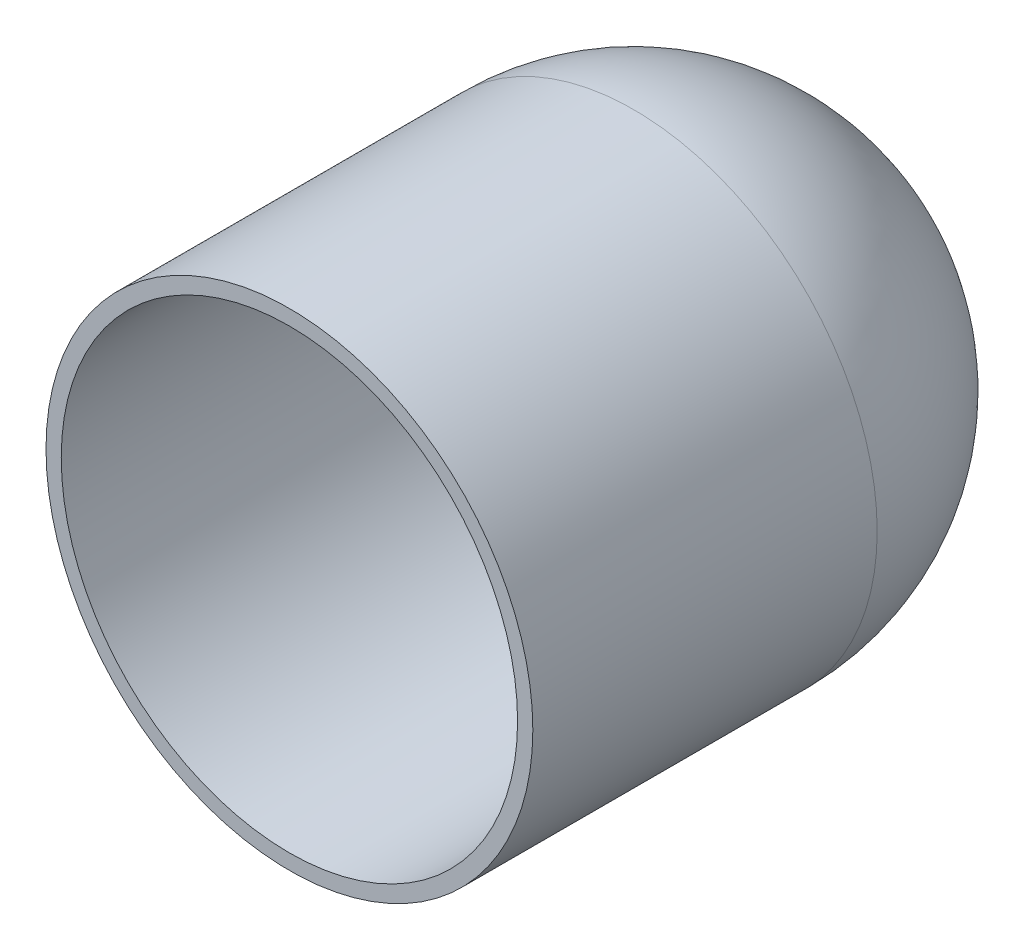
ISO-10303-21;
HEADER;
FILE_DESCRIPTION(('STEP AP214'),'2;1');
FILE_NAME('part.step','',(''),(''),'','','');
FILE_SCHEMA(('AUTOMOTIVE_DESIGN { 1 0 10303 214 1 1 1 1 }'));
ENDSEC;
DATA;
#1=APPLICATION_CONTEXT('core data for automotive mechanical design processes');
#2=APPLICATION_PROTOCOL_DEFINITION('international standard','automotive_design',2000,#1);
#3=PRODUCT_CONTEXT('',#1,'mechanical');
#4=PRODUCT('Part','Part','',(#3));
#5=PRODUCT_RELATED_PRODUCT_CATEGORY('part','',(#4));
#6=PRODUCT_DEFINITION_FORMATION('','',#4);
#7=PRODUCT_DEFINITION_CONTEXT('part definition',#1,'design');
#8=PRODUCT_DEFINITION('design','',#6,#7);
#9=PRODUCT_DEFINITION_SHAPE('','',#8);
#10=(LENGTH_UNIT() NAMED_UNIT(*) SI_UNIT(.MILLI.,.METRE.));
#11=(NAMED_UNIT(*) PLANE_ANGLE_UNIT() SI_UNIT($,.RADIAN.));
#12=(NAMED_UNIT(*) SI_UNIT($,.STERADIAN.) SOLID_ANGLE_UNIT());
#13=UNCERTAINTY_MEASURE_WITH_UNIT(LENGTH_MEASURE(1.E-05),#10,'distance_accuracy_value','');
#14=(GEOMETRIC_REPRESENTATION_CONTEXT(3) GLOBAL_UNCERTAINTY_ASSIGNED_CONTEXT((#13)) GLOBAL_UNIT_ASSIGNED_CONTEXT((#10,
#11,#12)) REPRESENTATION_CONTEXT('',''));
#15=CARTESIAN_POINT('',(0.,0.,0.));
#16=DIRECTION('',(0.,0.,1.));
#17=DIRECTION('',(1.,0.,0.));
#18=AXIS2_PLACEMENT_3D('',#15,#16,#17);
#19=CARTESIAN_POINT('',(0.,0.,-44.));
#20=DIRECTION('',(0.,0.,1.));
#21=DIRECTION('',(1.,0.,0.));
#22=AXIS2_PLACEMENT_3D('',#19,#20,#21);
#23=CYLINDRICAL_SURFACE('',#22,5.6730951365591);
#24=CARTESIAN_POINT('',(0.,0.,-21.8970407035186));
#25=DIRECTION('',(0.,0.,1.));
#26=DIRECTION('',(1.,0.,0.));
#27=AXIS2_PLACEMENT_3D('',#24,#25,#26);
#28=CIRCLE('',#27,5.6730951365591);
#29=CARTESIAN_POINT('',(5.6730951365591,0.,-21.8970407035186));
#30=VERTEX_POINT('',#29);
#31=EDGE_CURVE('E50',#30,#30,#28,.T.);
#32=ORIENTED_EDGE('',*,*,#31,.F.);
#33=EDGE_LOOP('',(#32));
#34=FACE_BOUND('',#33,.T.);
#35=CARTESIAN_POINT('',(0.,0.,0.999999999999994));
#36=DIRECTION('',(0.,0.,1.));
#37=DIRECTION('',(1.,0.,0.));
#38=AXIS2_PLACEMENT_3D('',#35,#36,#37);
#39=CIRCLE('',#38,5.6730951365591);
#40=CARTESIAN_POINT('',(5.6730951365591,0.,0.999999999999994));
#41=VERTEX_POINT('',#40);
#42=EDGE_CURVE('E41',#41,#41,#39,.F.);
#43=ORIENTED_EDGE('',*,*,#42,.F.);
#44=EDGE_LOOP('',(#43));
#45=FACE_BOUND('',#44,.T.);
#46=ADVANCED_FACE('F37',(#34,#45),#23,.F.);
#47=CARTESIAN_POINT('',(0.,0.,32.));
#48=DIRECTION('',(0.,0.,-1.));
#49=DIRECTION('',(-1.,0.,0.));
#50=AXIS2_PLACEMENT_3D('',#47,#48,#49);
#51=CYLINDRICAL_SURFACE('',#50,22.62);
#52=CARTESIAN_POINT('',(0.,0.,32.));
#53=DIRECTION('',(0.,0.,1.));
#54=DIRECTION('',(1.,0.,0.));
#55=AXIS2_PLACEMENT_3D('',#52,#53,#54);
#56=CIRCLE('',#55,22.62);
#57=CARTESIAN_POINT('',(22.62,0.,32.));
#58=VERTEX_POINT('',#57);
#59=EDGE_CURVE('E10',#58,#58,#56,.T.);
#60=ORIENTED_EDGE('',*,*,#59,.F.);
#61=EDGE_LOOP('',(#60));
#62=FACE_BOUND('',#61,.T.);
#63=CARTESIAN_POINT('',(0.,0.,0.));
#64=DIRECTION('',(0.,0.,1.));
#65=DIRECTION('',(1.,0.,0.));
#66=AXIS2_PLACEMENT_3D('',#63,#64,#65);
#67=CIRCLE('',#66,22.62);
#68=CARTESIAN_POINT('',(22.62,0.,0.));
#69=VERTEX_POINT('',#68);
#70=EDGE_CURVE('E45',#69,#69,#67,.F.);
#71=ORIENTED_EDGE('',*,*,#70,.F.);
#72=EDGE_LOOP('',(#71));
#73=FACE_BOUND('',#72,.T.);
#74=ADVANCED_FACE('F39',(#62,#73),#51,.T.);
#75=CARTESIAN_POINT('',(0.,0.,32.));
#76=DIRECTION('',(0.,0.,1.));
#77=DIRECTION('',(1.,0.,0.));
#78=AXIS2_PLACEMENT_3D('',#75,#76,#77);
#79=PLANE('',#78);
#80=CARTESIAN_POINT('',(0.,0.,32.));
#81=DIRECTION('',(0.,0.,1.));
#82=DIRECTION('',(1.,0.,0.));
#83=AXIS2_PLACEMENT_3D('',#80,#81,#82);
#84=CIRCLE('',#83,21.2036874620984);
#85=CARTESIAN_POINT('',(21.2036874620984,0.,32.));
#86=VERTEX_POINT('',#85);
#87=EDGE_CURVE('E61',#86,#86,#84,.T.);
#88=ORIENTED_EDGE('',*,*,#87,.F.);
#89=EDGE_LOOP('',(#88));
#90=FACE_BOUND('',#89,.T.);
#91=ORIENTED_EDGE('',*,*,#59,.T.);
#92=EDGE_LOOP('',(#91));
#93=FACE_BOUND('',#92,.T.);
#94=ADVANCED_FACE('F70',(#90,#93),#79,.T.);
#95=CARTESIAN_POINT('',(0.,0.,0.));
#96=DIRECTION('',(0.,-1.,0.));
#97=DIRECTION('',(1.,0.,0.));
#98=AXIS2_PLACEMENT_3D('',#95,#96,#97);
#99=SPHERICAL_SURFACE('',#98,22.62);
#100=CARTESIAN_POINT('',(0.,0.,0.));
#101=DIRECTION('',(0.,0.,1.));
#102=DIRECTION('',(1.,0.,0.));
#103=AXIS2_PLACEMENT_3D('',#100,#101,#102);
#104=SPHERICAL_SURFACE('',#103,22.62);
#105=ORIENTED_EDGE('',*,*,#31,.T.);
#106=EDGE_LOOP('',(#105));
#107=FACE_BOUND('',#106,.T.);
#108=ORIENTED_EDGE('',*,*,#70,.T.);
#109=EDGE_LOOP('',(#108));
#110=FACE_BOUND('',#109,.T.);
#111=ADVANCED_FACE('F72',(#107,#110),#104,.T.);
#112=CARTESIAN_POINT('',(0.,0.,0.999999999999994));
#113=DIRECTION('',(0.,0.,1.));
#114=DIRECTION('',(1.,0.,0.));
#115=AXIS2_PLACEMENT_3D('',#112,#113,#114);
#116=PLANE('',#115);
#117=CARTESIAN_POINT('',(0.,0.,0.999999999999994));
#118=DIRECTION('',(0.,0.,1.));
#119=DIRECTION('',(1.,0.,0.));
#120=AXIS2_PLACEMENT_3D('',#117,#118,#119);
#121=CIRCLE('',#120,21.2036874620984);
#122=CARTESIAN_POINT('',(21.2036874620984,0.,0.999999999999994));
#123=VERTEX_POINT('',#122);
#124=EDGE_CURVE('E57',#123,#123,#121,.T.);
#125=ORIENTED_EDGE('',*,*,#124,.T.);
#126=EDGE_LOOP('',(#125));
#127=FACE_BOUND('',#126,.T.);
#128=ORIENTED_EDGE('',*,*,#42,.T.);
#129=EDGE_LOOP('',(#128));
#130=FACE_BOUND('',#129,.T.);
#131=ADVANCED_FACE('F77',(#127,#130),#116,.T.);
#132=CARTESIAN_POINT('',(0.,0.,0.999999999999994));
#133=DIRECTION('',(0.,0.,1.));
#134=DIRECTION('',(1.,0.,0.));
#135=AXIS2_PLACEMENT_3D('',#132,#133,#134);
#136=CYLINDRICAL_SURFACE('',#135,21.2036874620984);
#137=ORIENTED_EDGE('',*,*,#124,.F.);
#138=EDGE_LOOP('',(#137));
#139=FACE_BOUND('',#138,.T.);
#140=ORIENTED_EDGE('',*,*,#87,.T.);
#141=EDGE_LOOP('',(#140));
#142=FACE_BOUND('',#141,.T.);
#143=ADVANCED_FACE('F68',(#139,#142),#136,.F.);
#144=CLOSED_SHELL('',(#46,#74,#94,#111,#131,#143));
#145=MANIFOLD_SOLID_BREP('B2',#144);
#146=ADVANCED_BREP_SHAPE_REPRESENTATION('',(#18,#145),#14);
#147=SHAPE_DEFINITION_REPRESENTATION(#9,#146);
ENDSEC;
END-ISO-10303-21;
